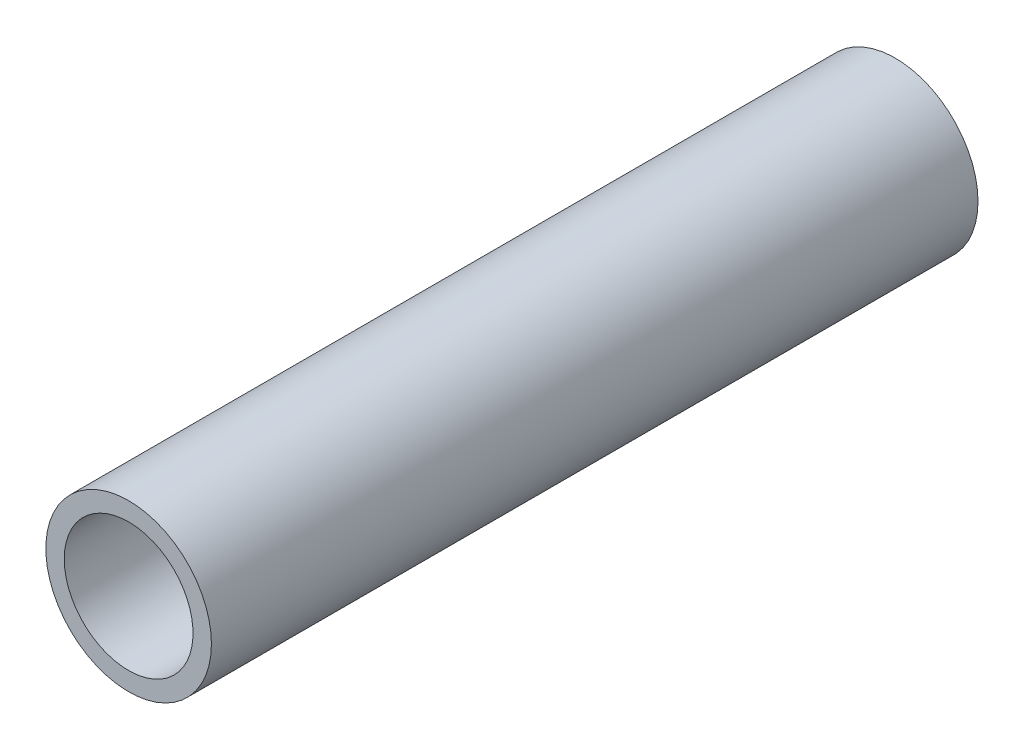
ISO-10303-21;
HEADER;
FILE_DESCRIPTION(('STEP AP214'),'2;1');
FILE_NAME('part.step','',(''),(''),'','','');
FILE_SCHEMA(('AUTOMOTIVE_DESIGN { 1 0 10303 214 1 1 1 1 }'));
ENDSEC;
DATA;
#1=APPLICATION_CONTEXT('core data for automotive mechanical design processes');
#2=APPLICATION_PROTOCOL_DEFINITION('international standard','automotive_design',2000,#1);
#3=PRODUCT_CONTEXT('',#1,'mechanical');
#4=PRODUCT('Part','Part','',(#3));
#5=PRODUCT_RELATED_PRODUCT_CATEGORY('part','',(#4));
#6=PRODUCT_DEFINITION_FORMATION('','',#4);
#7=PRODUCT_DEFINITION_CONTEXT('part definition',#1,'design');
#8=PRODUCT_DEFINITION('design','',#6,#7);
#9=PRODUCT_DEFINITION_SHAPE('','',#8);
#10=(LENGTH_UNIT() NAMED_UNIT(*) SI_UNIT(.MILLI.,.METRE.));
#11=(NAMED_UNIT(*) PLANE_ANGLE_UNIT() SI_UNIT($,.RADIAN.));
#12=(NAMED_UNIT(*) SI_UNIT($,.STERADIAN.) SOLID_ANGLE_UNIT());
#13=UNCERTAINTY_MEASURE_WITH_UNIT(LENGTH_MEASURE(1.E-05),#10,'distance_accuracy_value','');
#14=(GEOMETRIC_REPRESENTATION_CONTEXT(3) GLOBAL_UNCERTAINTY_ASSIGNED_CONTEXT((#13)) GLOBAL_UNIT_ASSIGNED_CONTEXT((#10,
#11,#12)) REPRESENTATION_CONTEXT('',''));
#15=CARTESIAN_POINT('',(0.,0.,0.));
#16=DIRECTION('',(0.,0.,1.));
#17=DIRECTION('',(1.,0.,0.));
#18=AXIS2_PLACEMENT_3D('',#15,#16,#17);
#19=CARTESIAN_POINT('',(-7.31916779058315,4.99702218634191,107.537201148065));
#20=DIRECTION('',(0.,0.,-1.));
#21=DIRECTION('',(-1.,0.,0.));
#22=AXIS2_PLACEMENT_3D('',#19,#20,#21);
#23=CYLINDRICAL_SURFACE('',#22,9.51203544798201);
#24=CARTESIAN_POINT('',(-7.31916779058315,4.99702218634191,107.537201148065));
#25=DIRECTION('',(0.,0.,1.));
#26=DIRECTION('',(1.,0.,0.));
#27=AXIS2_PLACEMENT_3D('',#24,#25,#26);
#28=CIRCLE('',#27,9.51203544798201);
#29=CARTESIAN_POINT('',(2.19286765739886,4.99702218634191,107.537201148065));
#30=VERTEX_POINT('',#29);
#31=EDGE_CURVE('E10',#30,#30,#28,.T.);
#32=ORIENTED_EDGE('',*,*,#31,.F.);
#33=EDGE_LOOP('',(#32));
#34=FACE_BOUND('',#33,.T.);
#35=CARTESIAN_POINT('',(-7.31916779058315,4.99702218634191,19.4627988519351));
#36=DIRECTION('',(0.,0.,1.));
#37=DIRECTION('',(1.,0.,0.));
#38=AXIS2_PLACEMENT_3D('',#35,#36,#37);
#39=CIRCLE('',#38,9.51203544798201);
#40=CARTESIAN_POINT('',(2.19286765739886,4.99702218634191,19.4627988519351));
#41=VERTEX_POINT('',#40);
#42=EDGE_CURVE('E39',#41,#41,#39,.T.);
#43=ORIENTED_EDGE('',*,*,#42,.T.);
#44=EDGE_LOOP('',(#43));
#45=FACE_BOUND('',#44,.T.);
#46=ADVANCED_FACE('F36',(#34,#45),#23,.T.);
#47=CARTESIAN_POINT('',(-7.31916779058315,4.99702218634191,107.537201148065));
#48=DIRECTION('',(0.,0.,1.));
#49=DIRECTION('',(1.,0.,0.));
#50=AXIS2_PLACEMENT_3D('',#47,#48,#49);
#51=PLANE('',#50);
#52=CARTESIAN_POINT('',(-7.31916779058315,4.99702218634191,107.537201148065));
#53=DIRECTION('',(0.,0.,-1.));
#54=DIRECTION('',(-1.,0.,0.));
#55=AXIS2_PLACEMENT_3D('',#52,#53,#54);
#56=CIRCLE('',#55,7.3982497928749);
#57=CARTESIAN_POINT('',(-14.717417583458,4.99702218634191,107.537201148065));
#58=VERTEX_POINT('',#57);
#59=EDGE_CURVE('E46',#58,#58,#56,.T.);
#60=ORIENTED_EDGE('',*,*,#59,.T.);
#61=EDGE_LOOP('',(#60));
#62=FACE_BOUND('',#61,.T.);
#63=ORIENTED_EDGE('',*,*,#31,.T.);
#64=EDGE_LOOP('',(#63));
#65=FACE_BOUND('',#64,.T.);
#66=ADVANCED_FACE('F54',(#62,#65),#51,.T.);
#67=CARTESIAN_POINT('',(-7.31916779058315,4.99702218634191,19.4627988519351));
#68=DIRECTION('',(0.,0.,1.));
#69=DIRECTION('',(1.,0.,0.));
#70=AXIS2_PLACEMENT_3D('',#67,#68,#69);
#71=PLANE('',#70);
#72=CARTESIAN_POINT('',(-7.31916779058315,4.99702218634191,19.4627988519351));
#73=DIRECTION('',(0.,0.,-1.));
#74=DIRECTION('',(-1.,0.,0.));
#75=AXIS2_PLACEMENT_3D('',#72,#73,#74);
#76=CIRCLE('',#75,7.3982497928749);
#77=CARTESIAN_POINT('',(-14.717417583458,4.99702218634191,19.4627988519351));
#78=VERTEX_POINT('',#77);
#79=EDGE_CURVE('E48',#78,#78,#76,.T.);
#80=ORIENTED_EDGE('',*,*,#79,.F.);
#81=EDGE_LOOP('',(#80));
#82=FACE_BOUND('',#81,.T.);
#83=ORIENTED_EDGE('',*,*,#42,.F.);
#84=EDGE_LOOP('',(#83));
#85=FACE_BOUND('',#84,.T.);
#86=ADVANCED_FACE('F59',(#82,#85),#71,.F.);
#87=CARTESIAN_POINT('',(-7.31916779058315,4.99702218634191,107.537201148065));
#88=DIRECTION('',(0.,0.,-1.));
#89=DIRECTION('',(-1.,0.,0.));
#90=AXIS2_PLACEMENT_3D('',#87,#88,#89);
#91=CYLINDRICAL_SURFACE('',#90,7.3982497928749);
#92=ORIENTED_EDGE('',*,*,#59,.F.);
#93=EDGE_LOOP('',(#92));
#94=FACE_BOUND('',#93,.T.);
#95=ORIENTED_EDGE('',*,*,#79,.T.);
#96=EDGE_LOOP('',(#95));
#97=FACE_BOUND('',#96,.T.);
#98=ADVANCED_FACE('F56',(#94,#97),#91,.F.);
#99=CLOSED_SHELL('',(#46,#66,#86,#98));
#100=MANIFOLD_SOLID_BREP('B2',#99);
#101=ADVANCED_BREP_SHAPE_REPRESENTATION('',(#18,#100),#14);
#102=SHAPE_DEFINITION_REPRESENTATION(#9,#101);
ENDSEC;
END-ISO-10303-21;
